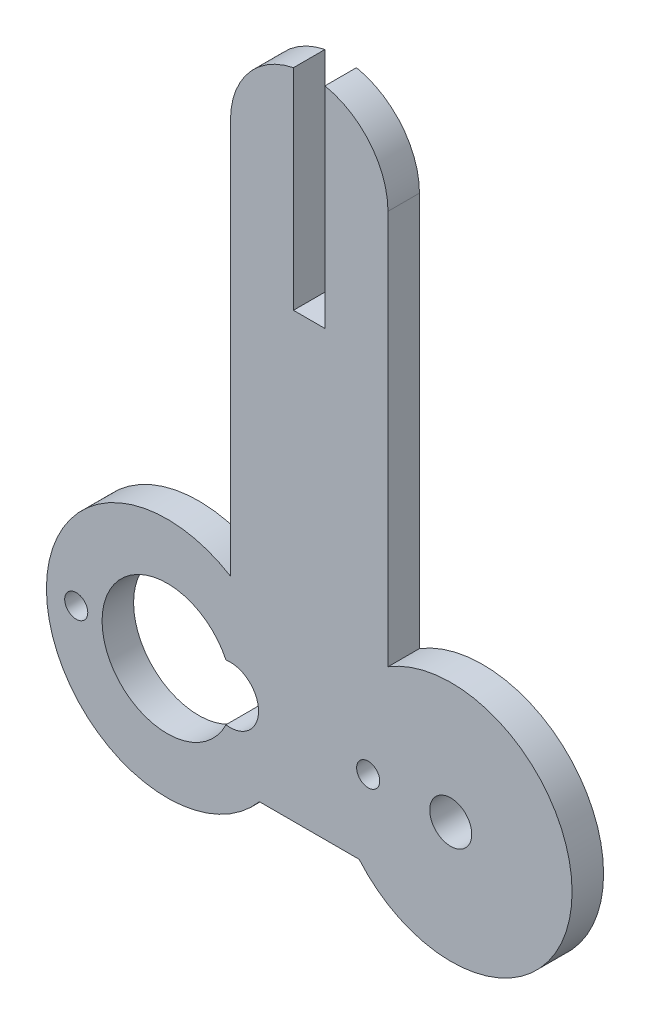
ISO-10303-21;
HEADER;
FILE_DESCRIPTION(('STEP AP214'),'2;1');
FILE_NAME('part.step','',(''),(''),'','','');
FILE_SCHEMA(('AUTOMOTIVE_DESIGN { 1 0 10303 214 1 1 1 1 }'));
ENDSEC;
DATA;
#1=APPLICATION_CONTEXT('core data for automotive mechanical design processes');
#2=APPLICATION_PROTOCOL_DEFINITION('international standard','automotive_design',2000,#1);
#3=PRODUCT_CONTEXT('',#1,'mechanical');
#4=PRODUCT('Part','Part','',(#3));
#5=PRODUCT_RELATED_PRODUCT_CATEGORY('part','',(#4));
#6=PRODUCT_DEFINITION_FORMATION('','',#4);
#7=PRODUCT_DEFINITION_CONTEXT('part definition',#1,'design');
#8=PRODUCT_DEFINITION('design','',#6,#7);
#9=PRODUCT_DEFINITION_SHAPE('','',#8);
#10=(LENGTH_UNIT() NAMED_UNIT(*) SI_UNIT(.MILLI.,.METRE.));
#11=(NAMED_UNIT(*) PLANE_ANGLE_UNIT() SI_UNIT($,.RADIAN.));
#12=(NAMED_UNIT(*) SI_UNIT($,.STERADIAN.) SOLID_ANGLE_UNIT());
#13=UNCERTAINTY_MEASURE_WITH_UNIT(LENGTH_MEASURE(1.E-05),#10,'distance_accuracy_value','');
#14=(GEOMETRIC_REPRESENTATION_CONTEXT(3) GLOBAL_UNCERTAINTY_ASSIGNED_CONTEXT((#13)) GLOBAL_UNIT_ASSIGNED_CONTEXT((#10,
#11,#12)) REPRESENTATION_CONTEXT('',''));
#15=CARTESIAN_POINT('',(0.,0.,0.));
#16=DIRECTION('',(0.,0.,1.));
#17=DIRECTION('',(1.,0.,0.));
#18=AXIS2_PLACEMENT_3D('',#15,#16,#17);
#19=CARTESIAN_POINT('',(27.0101339999242,-2.02521917807232E-11,3.));
#20=DIRECTION('',(-1.,7.4979975222559E-13,0.));
#21=DIRECTION('',(-7.4979975222559E-13,-1.,0.));
#22=AXIS2_PLACEMENT_3D('',#19,#20,#21);
#23=PLANE('',#22);
#24=DIRECTION('',(7.4979975222559E-13,1.,0.));
#25=VECTOR('',#24,1.);
#26=CARTESIAN_POINT('',(27.0101339999242,-2.02521917807232E-11,0.));
#27=LINE('',#26,#25);
#28=CARTESIAN_POINT('',(27.010134,81.0529065364326,0.));
#29=VERTEX_POINT('',#28);
#30=CARTESIAN_POINT('',(27.010134,101.06216086585,0.));
#31=VERTEX_POINT('',#30);
#32=EDGE_CURVE('E174',#29,#31,#27,.T.);
#33=ORIENTED_EDGE('',*,*,#32,.T.);
#34=DIRECTION('',(0.,0.,-1.));
#35=VECTOR('',#34,1.);
#36=CARTESIAN_POINT('',(27.010134,101.06216086585,3.));
#37=LINE('',#36,#35);
#38=CARTESIAN_POINT('',(27.010134,101.06216086585,3.));
#39=VERTEX_POINT('',#38);
#40=EDGE_CURVE('E11',#39,#31,#37,.T.);
#41=ORIENTED_EDGE('',*,*,#40,.F.);
#42=DIRECTION('',(7.4979975222559E-13,1.,0.));
#43=VECTOR('',#42,1.);
#44=CARTESIAN_POINT('',(27.0101339999242,-2.02521917807232E-11,3.));
#45=LINE('',#44,#43);
#46=CARTESIAN_POINT('',(27.010134,81.0529065364326,3.));
#47=VERTEX_POINT('',#46);
#48=EDGE_CURVE('E272',#47,#39,#45,.T.);
#49=ORIENTED_EDGE('',*,*,#48,.F.);
#50=DIRECTION('',(0.,0.,-1.));
#51=VECTOR('',#50,1.);
#52=CARTESIAN_POINT('',(27.010134,81.0529065364326,3.));
#53=LINE('',#52,#51);
#54=EDGE_CURVE('E55',#47,#29,#53,.T.);
#55=ORIENTED_EDGE('',*,*,#54,.T.);
#56=EDGE_LOOP('',(#33,#41,#49,#55));
#57=FACE_BOUND('',#56,.T.);
#58=ADVANCED_FACE('F36',(#57),#23,.F.);
#59=CARTESIAN_POINT('',(28.5101338889917,93.7136915015433,3.));
#60=DIRECTION('',(0.,0.,-1.));
#61=DIRECTION('',(-1.,0.,0.));
#62=AXIS2_PLACEMENT_3D('',#59,#60,#61);
#63=CYLINDRICAL_SURFACE('',#62,7.50000050000001);
#64=CARTESIAN_POINT('',(28.5101338889917,93.7136915015433,0.));
#65=DIRECTION('',(0.,0.,1.));
#66=DIRECTION('',(1.,0.,0.));
#67=AXIS2_PLACEMENT_3D('',#64,#65,#66);
#68=CIRCLE('',#67,7.50000050000001);
#69=CARTESIAN_POINT('',(21.010133,93.713692,0.));
#70=VERTEX_POINT('',#69);
#71=EDGE_CURVE('E176',#31,#70,#68,.T.);
#72=ORIENTED_EDGE('',*,*,#71,.T.);
#73=DIRECTION('',(0.,0.,-1.));
#74=VECTOR('',#73,1.);
#75=CARTESIAN_POINT('',(21.010133,93.713692,3.));
#76=LINE('',#75,#74);
#77=CARTESIAN_POINT('',(21.010133,93.713692,3.));
#78=VERTEX_POINT('',#77);
#79=EDGE_CURVE('E46',#78,#70,#76,.T.);
#80=ORIENTED_EDGE('',*,*,#79,.F.);
#81=CARTESIAN_POINT('',(28.5101338889917,93.7136915015433,3.));
#82=DIRECTION('',(0.,0.,1.));
#83=DIRECTION('',(1.,0.,0.));
#84=AXIS2_PLACEMENT_3D('',#81,#82,#83);
#85=CIRCLE('',#84,7.50000050000001);
#86=EDGE_CURVE('E274',#39,#78,#85,.T.);
#87=ORIENTED_EDGE('',*,*,#86,.F.);
#88=ORIENTED_EDGE('',*,*,#40,.T.);
#89=EDGE_LOOP('',(#72,#80,#87,#88));
#90=FACE_BOUND('',#89,.T.);
#91=ADVANCED_FACE('F240',(#90),#63,.T.);
#92=CARTESIAN_POINT('',(21.010133,0.,3.));
#93=DIRECTION('',(-1.,0.,0.));
#94=DIRECTION('',(0.,0.,1.));
#95=AXIS2_PLACEMENT_3D('',#92,#93,#94);
#96=PLANE('',#95);
#97=DIRECTION('',(0.,1.,0.));
#98=VECTOR('',#97,1.);
#99=CARTESIAN_POINT('',(21.010133,0.,0.));
#100=LINE('',#99,#98);
#101=CARTESIAN_POINT('',(21.010133,56.1278109712173,0.));
#102=VERTEX_POINT('',#101);
#103=EDGE_CURVE('E179',#102,#70,#100,.T.);
#104=ORIENTED_EDGE('',*,*,#103,.F.);
#105=DIRECTION('',(0.,0.,-1.));
#106=VECTOR('',#105,1.);
#107=CARTESIAN_POINT('',(21.010133,56.1278109712173,3.));
#108=LINE('',#107,#106);
#109=CARTESIAN_POINT('',(21.010133,56.1278109712173,3.));
#110=VERTEX_POINT('',#109);
#111=EDGE_CURVE('E210',#110,#102,#108,.T.);
#112=ORIENTED_EDGE('',*,*,#111,.F.);
#113=DIRECTION('',(0.,1.,0.));
#114=VECTOR('',#113,1.);
#115=CARTESIAN_POINT('',(21.010133,0.,3.));
#116=LINE('',#115,#114);
#117=EDGE_CURVE('E276',#110,#78,#116,.T.);
#118=ORIENTED_EDGE('',*,*,#117,.T.);
#119=ORIENTED_EDGE('',*,*,#79,.T.);
#120=EDGE_LOOP('',(#104,#112,#118,#119));
#121=FACE_BOUND('',#120,.T.);
#122=ADVANCED_FACE('F245',(#121),#96,.T.);
#123=CARTESIAN_POINT('',(14.9863790648484,46.3322028764428,3.));
#124=DIRECTION('',(0.,0.,-1.));
#125=DIRECTION('',(-1.,0.,0.));
#126=AXIS2_PLACEMENT_3D('',#123,#124,#125);
#127=CYLINDRICAL_SURFACE('',#126,11.4995456178784);
#128=CARTESIAN_POINT('',(14.9863790648484,46.3322028764428,0.));
#129=DIRECTION('',(0.,0.,1.));
#130=DIRECTION('',(1.,0.,0.));
#131=AXIS2_PLACEMENT_3D('',#128,#129,#130);
#132=CIRCLE('',#131,11.4995456178784);
#133=CARTESIAN_POINT('',(23.766391,38.905835,0.));
#134=VERTEX_POINT('',#133);
#135=EDGE_CURVE('E182',#102,#134,#132,.T.);
#136=ORIENTED_EDGE('',*,*,#135,.T.);
#137=DIRECTION('',(0.,0.,-1.));
#138=VECTOR('',#137,1.);
#139=CARTESIAN_POINT('',(23.766391,38.905835,3.));
#140=LINE('',#139,#138);
#141=CARTESIAN_POINT('',(23.766391,38.905835,3.));
#142=VERTEX_POINT('',#141);
#143=EDGE_CURVE('E207',#142,#134,#140,.T.);
#144=ORIENTED_EDGE('',*,*,#143,.F.);
#145=CARTESIAN_POINT('',(14.9863790648484,46.3322028764428,3.));
#146=DIRECTION('',(0.,0.,1.));
#147=DIRECTION('',(1.,0.,0.));
#148=AXIS2_PLACEMENT_3D('',#145,#146,#147);
#149=CIRCLE('',#148,11.4995456178784);
#150=EDGE_CURVE('E279',#110,#142,#149,.T.);
#151=ORIENTED_EDGE('',*,*,#150,.F.);
#152=ORIENTED_EDGE('',*,*,#111,.T.);
#153=EDGE_LOOP('',(#136,#144,#151,#152));
#154=FACE_BOUND('',#153,.T.);
#155=ADVANCED_FACE('F301',(#154),#127,.T.);
#156=CARTESIAN_POINT('',(0.,38.905835,3.));
#157=DIRECTION('',(0.,1.,0.));
#158=DIRECTION('',(0.,0.,1.));
#159=AXIS2_PLACEMENT_3D('',#156,#157,#158);
#160=PLANE('',#159);
#161=DIRECTION('',(1.,0.,0.));
#162=VECTOR('',#161,1.);
#163=CARTESIAN_POINT('',(0.,38.905835,0.));
#164=LINE('',#163,#162);
#165=CARTESIAN_POINT('',(33.2646813163217,38.905835,0.));
#166=VERTEX_POINT('',#165);
#167=EDGE_CURVE('E184',#134,#166,#164,.T.);
#168=ORIENTED_EDGE('',*,*,#167,.T.);
#169=DIRECTION('',(0.,0.,-1.));
#170=VECTOR('',#169,1.);
#171=CARTESIAN_POINT('',(33.2646813163217,38.905835,3.));
#172=LINE('',#171,#170);
#173=CARTESIAN_POINT('',(33.2646813163217,38.905835,3.));
#174=VERTEX_POINT('',#173);
#175=EDGE_CURVE('E204',#174,#166,#172,.T.);
#176=ORIENTED_EDGE('',*,*,#175,.F.);
#177=DIRECTION('',(1.,0.,0.));
#178=VECTOR('',#177,1.);
#179=CARTESIAN_POINT('',(0.,38.905835,3.));
#180=LINE('',#179,#178);
#181=EDGE_CURVE('E281',#142,#174,#180,.T.);
#182=ORIENTED_EDGE('',*,*,#181,.F.);
#183=ORIENTED_EDGE('',*,*,#143,.T.);
#184=EDGE_LOOP('',(#168,#176,#182,#183));
#185=FACE_BOUND('',#184,.T.);
#186=ADVANCED_FACE('F297',(#185),#160,.F.);
#187=CARTESIAN_POINT('',(42.0358981007067,46.3528009508861,3.));
#188=DIRECTION('',(0.,0.,-1.));
#189=DIRECTION('',(-1.,0.,0.));
#190=AXIS2_PLACEMENT_3D('',#187,#188,#189);
#191=CYLINDRICAL_SURFACE('',#190,11.506152517342);
#192=CARTESIAN_POINT('',(42.0358981007067,46.3528009508861,0.));
#193=DIRECTION('',(0.,0.,1.));
#194=DIRECTION('',(1.,0.,0.));
#195=AXIS2_PLACEMENT_3D('',#192,#193,#194);
#196=CIRCLE('',#195,11.506152517342);
#197=CARTESIAN_POINT('',(36.010134,56.1549289216366,0.));
#198=VERTEX_POINT('',#197);
#199=EDGE_CURVE('E186',#166,#198,#196,.T.);
#200=ORIENTED_EDGE('',*,*,#199,.T.);
#201=DIRECTION('',(0.,0.,-1.));
#202=VECTOR('',#201,1.);
#203=CARTESIAN_POINT('',(36.010134,56.1549289216366,3.));
#204=LINE('',#203,#202);
#205=CARTESIAN_POINT('',(36.010134,56.1549289216366,3.));
#206=VERTEX_POINT('',#205);
#207=EDGE_CURVE('E202',#206,#198,#204,.T.);
#208=ORIENTED_EDGE('',*,*,#207,.F.);
#209=CARTESIAN_POINT('',(42.0358981007067,46.3528009508861,3.));
#210=DIRECTION('',(0.,0.,1.));
#211=DIRECTION('',(1.,0.,0.));
#212=AXIS2_PLACEMENT_3D('',#209,#210,#211);
#213=CIRCLE('',#212,11.506152517342);
#214=EDGE_CURVE('E283',#174,#206,#213,.T.);
#215=ORIENTED_EDGE('',*,*,#214,.F.);
#216=ORIENTED_EDGE('',*,*,#175,.T.);
#217=EDGE_LOOP('',(#200,#208,#215,#216));
#218=FACE_BOUND('',#217,.T.);
#219=ADVANCED_FACE('F292',(#218),#191,.T.);
#220=CARTESIAN_POINT('',(36.0101340000797,5.11003451424297E-11,3.));
#221=DIRECTION('',(1.,1.41905456787016E-12,0.));
#222=DIRECTION('',(-1.41905456787016E-12,1.,0.));
#223=AXIS2_PLACEMENT_3D('',#220,#221,#222);
#224=PLANE('',#223);
#225=DIRECTION('',(1.41905456787016E-12,-1.,0.));
#226=VECTOR('',#225,1.);
#227=CARTESIAN_POINT('',(36.0101340000797,5.11003451424297E-11,0.));
#228=LINE('',#227,#226);
#229=CARTESIAN_POINT('',(36.010134,93.7136915015433,0.));
#230=VERTEX_POINT('',#229);
#231=EDGE_CURVE('E189',#230,#198,#228,.T.);
#232=ORIENTED_EDGE('',*,*,#231,.F.);
#233=DIRECTION('',(0.,0.,-1.));
#234=VECTOR('',#233,1.);
#235=CARTESIAN_POINT('',(36.010134,93.7136915015433,3.));
#236=LINE('',#235,#234);
#237=CARTESIAN_POINT('',(36.010134,93.7136915015433,3.));
#238=VERTEX_POINT('',#237);
#239=EDGE_CURVE('E152',#238,#230,#236,.T.);
#240=ORIENTED_EDGE('',*,*,#239,.F.);
#241=DIRECTION('',(1.41905456787016E-12,-1.,0.));
#242=VECTOR('',#241,1.);
#243=CARTESIAN_POINT('',(36.0101340000797,5.11003451424297E-11,3.));
#244=LINE('',#243,#242);
#245=EDGE_CURVE('E142',#238,#206,#244,.T.);
#246=ORIENTED_EDGE('',*,*,#245,.T.);
#247=ORIENTED_EDGE('',*,*,#207,.T.);
#248=EDGE_LOOP('',(#232,#240,#246,#247));
#249=FACE_BOUND('',#248,.T.);
#250=ADVANCED_FACE('F286',(#249),#224,.T.);
#251=CARTESIAN_POINT('',(28.5101338889917,93.7136915015433,3.));
#252=DIRECTION('',(0.,0.,-1.));
#253=DIRECTION('',(-1.,0.,0.));
#254=AXIS2_PLACEMENT_3D('',#251,#252,#253);
#255=CYLINDRICAL_SURFACE('',#254,7.50000011100829);
#256=CARTESIAN_POINT('',(28.5101338889917,93.7136915015433,0.));
#257=DIRECTION('',(0.,0.,1.));
#258=DIRECTION('',(1.,0.,0.));
#259=AXIS2_PLACEMENT_3D('',#256,#257,#258);
#260=CIRCLE('',#259,7.50000011100829);
#261=CARTESIAN_POINT('',(30.010134,101.062160820531,0.));
#262=VERTEX_POINT('',#261);
#263=EDGE_CURVE('E149',#230,#262,#260,.T.);
#264=ORIENTED_EDGE('',*,*,#263,.T.);
#265=DIRECTION('',(0.,0.,-1.));
#266=VECTOR('',#265,1.);
#267=CARTESIAN_POINT('',(30.010134,101.062160820531,3.));
#268=LINE('',#267,#266);
#269=CARTESIAN_POINT('',(30.010134,101.062160820531,3.));
#270=VERTEX_POINT('',#269);
#271=EDGE_CURVE('E146',#270,#262,#268,.T.);
#272=ORIENTED_EDGE('',*,*,#271,.F.);
#273=CARTESIAN_POINT('',(28.5101338889917,93.7136915015433,3.));
#274=DIRECTION('',(0.,0.,1.));
#275=DIRECTION('',(1.,0.,0.));
#276=AXIS2_PLACEMENT_3D('',#273,#274,#275);
#277=CIRCLE('',#276,7.50000011100829);
#278=EDGE_CURVE('E134',#238,#270,#277,.T.);
#279=ORIENTED_EDGE('',*,*,#278,.F.);
#280=ORIENTED_EDGE('',*,*,#239,.T.);
#281=EDGE_LOOP('',(#264,#272,#279,#280));
#282=FACE_BOUND('',#281,.T.);
#283=ADVANCED_FACE('F147',(#282),#255,.T.);
#284=CARTESIAN_POINT('',(30.010134,0.,3.));
#285=DIRECTION('',(-1.,0.,0.));
#286=DIRECTION('',(0.,0.,1.));
#287=AXIS2_PLACEMENT_3D('',#284,#285,#286);
#288=PLANE('',#287);
#289=DIRECTION('',(0.,1.,0.));
#290=VECTOR('',#289,1.);
#291=CARTESIAN_POINT('',(30.010134,0.,0.));
#292=LINE('',#291,#290);
#293=CARTESIAN_POINT('',(30.010134,81.0529065364326,0.));
#294=VERTEX_POINT('',#293);
#295=EDGE_CURVE('E193',#294,#262,#292,.T.);
#296=ORIENTED_EDGE('',*,*,#295,.F.);
#297=DIRECTION('',(0.,0.,-1.));
#298=VECTOR('',#297,1.);
#299=CARTESIAN_POINT('',(30.010134,81.0529065364326,3.));
#300=LINE('',#299,#298);
#301=CARTESIAN_POINT('',(30.010134,81.0529065364326,3.));
#302=VERTEX_POINT('',#301);
#303=EDGE_CURVE('E93',#302,#294,#300,.T.);
#304=ORIENTED_EDGE('',*,*,#303,.F.);
#305=DIRECTION('',(0.,1.,0.));
#306=VECTOR('',#305,1.);
#307=CARTESIAN_POINT('',(30.010134,0.,3.));
#308=LINE('',#307,#306);
#309=EDGE_CURVE('E140',#302,#270,#308,.T.);
#310=ORIENTED_EDGE('',*,*,#309,.T.);
#311=ORIENTED_EDGE('',*,*,#271,.T.);
#312=EDGE_LOOP('',(#296,#304,#310,#311));
#313=FACE_BOUND('',#312,.T.);
#314=ADVANCED_FACE('F154',(#313),#288,.T.);
#315=CARTESIAN_POINT('',(20.9862259982852,46.3327254398959,3.));
#316=DIRECTION('',(0.,0.,-1.));
#317=DIRECTION('',(-1.,0.,0.));
#318=AXIS2_PLACEMENT_3D('',#315,#316,#317);
#319=CYLINDRICAL_SURFACE('',#318,2.70000000171479);
#320=CARTESIAN_POINT('',(20.9862259982852,46.3327254398959,0.));
#321=DIRECTION('',(0.,0.,1.));
#322=DIRECTION('',(1.,0.,0.));
#323=AXIS2_PLACEMENT_3D('',#320,#321,#322);
#324=CIRCLE('',#323,2.70000000171479);
#325=CARTESIAN_POINT('',(20.5820594945621,43.6631469251247,0.));
#326=VERTEX_POINT('',#325);
#327=CARTESIAN_POINT('',(20.5820594812544,49.0023039526523,0.));
#328=VERTEX_POINT('',#327);
#329=EDGE_CURVE('E168',#326,#328,#324,.T.);
#330=ORIENTED_EDGE('',*,*,#329,.F.);
#331=DIRECTION('',(0.,0.,-1.));
#332=VECTOR('',#331,1.);
#333=CARTESIAN_POINT('',(20.5820594945621,43.6631469251247,3.));
#334=LINE('',#333,#332);
#335=CARTESIAN_POINT('',(20.5820594945621,43.6631469251247,3.));
#336=VERTEX_POINT('',#335);
#337=EDGE_CURVE('E40',#336,#326,#334,.T.);
#338=ORIENTED_EDGE('',*,*,#337,.F.);
#339=CARTESIAN_POINT('',(20.9862259982852,46.3327254398959,3.));
#340=DIRECTION('',(0.,0.,1.));
#341=DIRECTION('',(1.,0.,0.));
#342=AXIS2_PLACEMENT_3D('',#339,#340,#341);
#343=CIRCLE('',#342,2.70000000171479);
#344=CARTESIAN_POINT('',(20.5820594812544,49.0023039526523,3.));
#345=VERTEX_POINT('',#344);
#346=EDGE_CURVE('E264',#336,#345,#343,.T.);
#347=ORIENTED_EDGE('',*,*,#346,.T.);
#348=DIRECTION('',(0.,0.,-1.));
#349=VECTOR('',#348,1.);
#350=CARTESIAN_POINT('',(20.5820594812544,49.0023039526523,3.));
#351=LINE('',#350,#349);
#352=EDGE_CURVE('E157',#345,#328,#351,.T.);
#353=ORIENTED_EDGE('',*,*,#352,.T.);
#354=EDGE_LOOP('',(#330,#338,#347,#353));
#355=FACE_BOUND('',#354,.T.);
#356=ADVANCED_FACE('F218',(#355),#319,.F.);
#357=CARTESIAN_POINT('',(14.9862259947633,46.332725424941,3.));
#358=DIRECTION('',(0.,0.,-1.));
#359=DIRECTION('',(-1.,0.,0.));
#360=AXIS2_PLACEMENT_3D('',#357,#358,#359);
#361=CYLINDRICAL_SURFACE('',#360,6.20000015517357);
#362=CARTESIAN_POINT('',(14.9862259947633,46.332725424941,0.));
#363=DIRECTION('',(0.,0.,1.));
#364=DIRECTION('',(1.,0.,0.));
#365=AXIS2_PLACEMENT_3D('',#362,#363,#364);
#366=CIRCLE('',#365,6.20000015517357);
#367=EDGE_CURVE('E171',#328,#326,#366,.T.);
#368=ORIENTED_EDGE('',*,*,#367,.F.);
#369=ORIENTED_EDGE('',*,*,#352,.F.);
#370=CARTESIAN_POINT('',(14.9862259947633,46.332725424941,3.));
#371=DIRECTION('',(0.,0.,1.));
#372=DIRECTION('',(1.,0.,0.));
#373=AXIS2_PLACEMENT_3D('',#370,#371,#372);
#374=CIRCLE('',#373,6.20000015517357);
#375=EDGE_CURVE('E217',#345,#336,#374,.T.);
#376=ORIENTED_EDGE('',*,*,#375,.T.);
#377=ORIENTED_EDGE('',*,*,#337,.T.);
#378=EDGE_LOOP('',(#368,#369,#376,#377));
#379=FACE_BOUND('',#378,.T.);
#380=ADVANCED_FACE('F215',(#379),#361,.F.);
#381=CARTESIAN_POINT('',(6.326226,46.332725,3.));
#382=DIRECTION('',(0.,0.,-1.));
#383=DIRECTION('',(-1.,0.,0.));
#384=AXIS2_PLACEMENT_3D('',#381,#382,#383);
#385=CYLINDRICAL_SURFACE('',#384,1.1);
#386=CARTESIAN_POINT('',(6.326226,46.332725,3.));
#387=DIRECTION('',(0.,0.,1.));
#388=DIRECTION('',(1.,0.,0.));
#389=AXIS2_PLACEMENT_3D('',#386,#387,#388);
#390=CIRCLE('',#389,1.1);
#391=CARTESIAN_POINT('',(7.426226,46.332725,3.));
#392=VERTEX_POINT('',#391);
#393=EDGE_CURVE('E260',#392,#392,#390,.T.);
#394=ORIENTED_EDGE('',*,*,#393,.T.);
#395=EDGE_LOOP('',(#394));
#396=FACE_BOUND('',#395,.T.);
#397=CARTESIAN_POINT('',(6.326226,46.332725,0.));
#398=DIRECTION('',(0.,0.,1.));
#399=DIRECTION('',(1.,0.,0.));
#400=AXIS2_PLACEMENT_3D('',#397,#398,#399);
#401=CIRCLE('',#400,1.1);
#402=CARTESIAN_POINT('',(7.426226,46.332725,0.));
#403=VERTEX_POINT('',#402);
#404=EDGE_CURVE('E164',#403,#403,#401,.T.);
#405=ORIENTED_EDGE('',*,*,#404,.F.);
#406=EDGE_LOOP('',(#405));
#407=FACE_BOUND('',#406,.T.);
#408=ADVANCED_FACE('F236',(#396,#407),#385,.F.);
#409=CARTESIAN_POINT('',(34.126226,46.332725,3.));
#410=DIRECTION('',(0.,0.,-1.));
#411=DIRECTION('',(-1.,0.,0.));
#412=AXIS2_PLACEMENT_3D('',#409,#410,#411);
#413=CYLINDRICAL_SURFACE('',#412,1.1);
#414=CARTESIAN_POINT('',(34.126226,46.332725,3.));
#415=DIRECTION('',(0.,0.,1.));
#416=DIRECTION('',(1.,0.,0.));
#417=AXIS2_PLACEMENT_3D('',#414,#415,#416);
#418=CIRCLE('',#417,1.1);
#419=CARTESIAN_POINT('',(35.226226,46.332725,3.));
#420=VERTEX_POINT('',#419);
#421=EDGE_CURVE('E198',#420,#420,#418,.T.);
#422=ORIENTED_EDGE('',*,*,#421,.T.);
#423=EDGE_LOOP('',(#422));
#424=FACE_BOUND('',#423,.T.);
#425=CARTESIAN_POINT('',(34.126226,46.332725,0.));
#426=DIRECTION('',(0.,0.,1.));
#427=DIRECTION('',(1.,0.,0.));
#428=AXIS2_PLACEMENT_3D('',#425,#426,#427);
#429=CIRCLE('',#428,1.1);
#430=CARTESIAN_POINT('',(35.226226,46.332725,0.));
#431=VERTEX_POINT('',#430);
#432=EDGE_CURVE('E161',#431,#431,#429,.T.);
#433=ORIENTED_EDGE('',*,*,#432,.F.);
#434=EDGE_LOOP('',(#433));
#435=FACE_BOUND('',#434,.T.);
#436=ADVANCED_FACE('F38',(#424,#435),#413,.F.);
#437=CARTESIAN_POINT('',(0.,81.0529065364326,3.));
#438=DIRECTION('',(0.,1.,0.));
#439=DIRECTION('',(0.,0.,1.));
#440=AXIS2_PLACEMENT_3D('',#437,#438,#439);
#441=PLANE('',#440);
#442=DIRECTION('',(1.,0.,0.));
#443=VECTOR('',#442,1.);
#444=CARTESIAN_POINT('',(0.,81.0529065364326,0.));
#445=LINE('',#444,#443);
#446=EDGE_CURVE('E195',#29,#294,#445,.T.);
#447=ORIENTED_EDGE('',*,*,#446,.F.);
#448=ORIENTED_EDGE('',*,*,#54,.F.);
#449=DIRECTION('',(1.,0.,0.));
#450=VECTOR('',#449,1.);
#451=CARTESIAN_POINT('',(0.,81.0529065364326,3.));
#452=LINE('',#451,#450);
#453=EDGE_CURVE('E155',#47,#302,#452,.T.);
#454=ORIENTED_EDGE('',*,*,#453,.T.);
#455=ORIENTED_EDGE('',*,*,#303,.T.);
#456=EDGE_LOOP('',(#447,#448,#454,#455));
#457=FACE_BOUND('',#456,.T.);
#458=ADVANCED_FACE('F227',(#457),#441,.T.);
#459=CARTESIAN_POINT('',(0.,0.,3.));
#460=DIRECTION('',(0.,0.,1.));
#461=DIRECTION('',(1.,0.,0.));
#462=AXIS2_PLACEMENT_3D('',#459,#460,#461);
#463=PLANE('',#462);
#464=CARTESIAN_POINT('',(41.9862256025409,46.3327257411865,3.));
#465=DIRECTION('',(0.,0.,1.));
#466=DIRECTION('',(1.,0.,0.));
#467=AXIS2_PLACEMENT_3D('',#464,#465,#466);
#468=CIRCLE('',#467,2.);
#469=CARTESIAN_POINT('',(43.9862256025409,46.3327257411865,3.));
#470=VERTEX_POINT('',#469);
#471=EDGE_CURVE('E376',#470,#470,#468,.T.);
#472=ORIENTED_EDGE('',*,*,#471,.F.);
#473=EDGE_LOOP('',(#472));
#474=FACE_BOUND('',#473,.T.);
#475=ORIENTED_EDGE('',*,*,#421,.F.);
#476=EDGE_LOOP('',(#475));
#477=FACE_BOUND('',#476,.T.);
#478=ORIENTED_EDGE('',*,*,#393,.F.);
#479=EDGE_LOOP('',(#478));
#480=FACE_BOUND('',#479,.T.);
#481=ORIENTED_EDGE('',*,*,#346,.F.);
#482=ORIENTED_EDGE('',*,*,#375,.F.);
#483=EDGE_LOOP('',(#481,#482));
#484=FACE_BOUND('',#483,.T.);
#485=ORIENTED_EDGE('',*,*,#48,.T.);
#486=ORIENTED_EDGE('',*,*,#86,.T.);
#487=ORIENTED_EDGE('',*,*,#117,.F.);
#488=ORIENTED_EDGE('',*,*,#150,.T.);
#489=ORIENTED_EDGE('',*,*,#181,.T.);
#490=ORIENTED_EDGE('',*,*,#214,.T.);
#491=ORIENTED_EDGE('',*,*,#245,.F.);
#492=ORIENTED_EDGE('',*,*,#278,.T.);
#493=ORIENTED_EDGE('',*,*,#309,.F.);
#494=ORIENTED_EDGE('',*,*,#453,.F.);
#495=EDGE_LOOP('',(#485,#486,#487,#488,#489,#490,#491,#492,#493,#494));
#496=FACE_BOUND('',#495,.T.);
#497=ADVANCED_FACE('F137',(#474,#477,#480,#484,#496),#463,.T.);
#498=CARTESIAN_POINT('',(0.,0.,0.));
#499=DIRECTION('',(0.,0.,1.));
#500=DIRECTION('',(1.,0.,0.));
#501=AXIS2_PLACEMENT_3D('',#498,#499,#500);
#502=PLANE('',#501);
#503=CARTESIAN_POINT('',(41.9862256025409,46.3327257411865,0.));
#504=DIRECTION('',(0.,0.,1.));
#505=DIRECTION('',(1.,0.,0.));
#506=AXIS2_PLACEMENT_3D('',#503,#504,#505);
#507=CIRCLE('',#506,2.);
#508=CARTESIAN_POINT('',(43.9862256025409,46.3327257411865,0.));
#509=VERTEX_POINT('',#508);
#510=EDGE_CURVE('E165',#509,#509,#507,.T.);
#511=ORIENTED_EDGE('',*,*,#510,.T.);
#512=EDGE_LOOP('',(#511));
#513=FACE_BOUND('',#512,.T.);
#514=ORIENTED_EDGE('',*,*,#432,.T.);
#515=EDGE_LOOP('',(#514));
#516=FACE_BOUND('',#515,.T.);
#517=ORIENTED_EDGE('',*,*,#404,.T.);
#518=EDGE_LOOP('',(#517));
#519=FACE_BOUND('',#518,.T.);
#520=ORIENTED_EDGE('',*,*,#329,.T.);
#521=ORIENTED_EDGE('',*,*,#367,.T.);
#522=EDGE_LOOP('',(#520,#521));
#523=FACE_BOUND('',#522,.T.);
#524=ORIENTED_EDGE('',*,*,#32,.F.);
#525=ORIENTED_EDGE('',*,*,#446,.T.);
#526=ORIENTED_EDGE('',*,*,#295,.T.);
#527=ORIENTED_EDGE('',*,*,#263,.F.);
#528=ORIENTED_EDGE('',*,*,#231,.T.);
#529=ORIENTED_EDGE('',*,*,#199,.F.);
#530=ORIENTED_EDGE('',*,*,#167,.F.);
#531=ORIENTED_EDGE('',*,*,#135,.F.);
#532=ORIENTED_EDGE('',*,*,#103,.T.);
#533=ORIENTED_EDGE('',*,*,#71,.F.);
#534=EDGE_LOOP('',(#524,#525,#526,#527,#528,#529,#530,#531,#532,#533));
#535=FACE_BOUND('',#534,.T.);
#536=ADVANCED_FACE('F220',(#513,#516,#519,#523,#535),#502,.F.);
#537=CARTESIAN_POINT('',(41.9862256025409,46.3327257411865,0.));
#538=DIRECTION('',(0.,0.,1.));
#539=DIRECTION('',(1.,0.,0.));
#540=AXIS2_PLACEMENT_3D('',#537,#538,#539);
#541=CYLINDRICAL_SURFACE('',#540,2.);
#542=ORIENTED_EDGE('',*,*,#510,.F.);
#543=EDGE_LOOP('',(#542));
#544=FACE_BOUND('',#543,.T.);
#545=ORIENTED_EDGE('',*,*,#471,.T.);
#546=EDGE_LOOP('',(#545));
#547=FACE_BOUND('',#546,.T.);
#548=ADVANCED_FACE('F223',(#544,#547),#541,.F.);
#549=CLOSED_SHELL('',(#58,#91,#122,#155,#186,#219,#250,#283,#314,#356,#380,#408,#436,#458,#497,
#536,#548));
#550=MANIFOLD_SOLID_BREP('B2',#549);
#551=ADVANCED_BREP_SHAPE_REPRESENTATION('',(#18,#550),#14);
#552=SHAPE_DEFINITION_REPRESENTATION(#9,#551);
ENDSEC;
END-ISO-10303-21;
